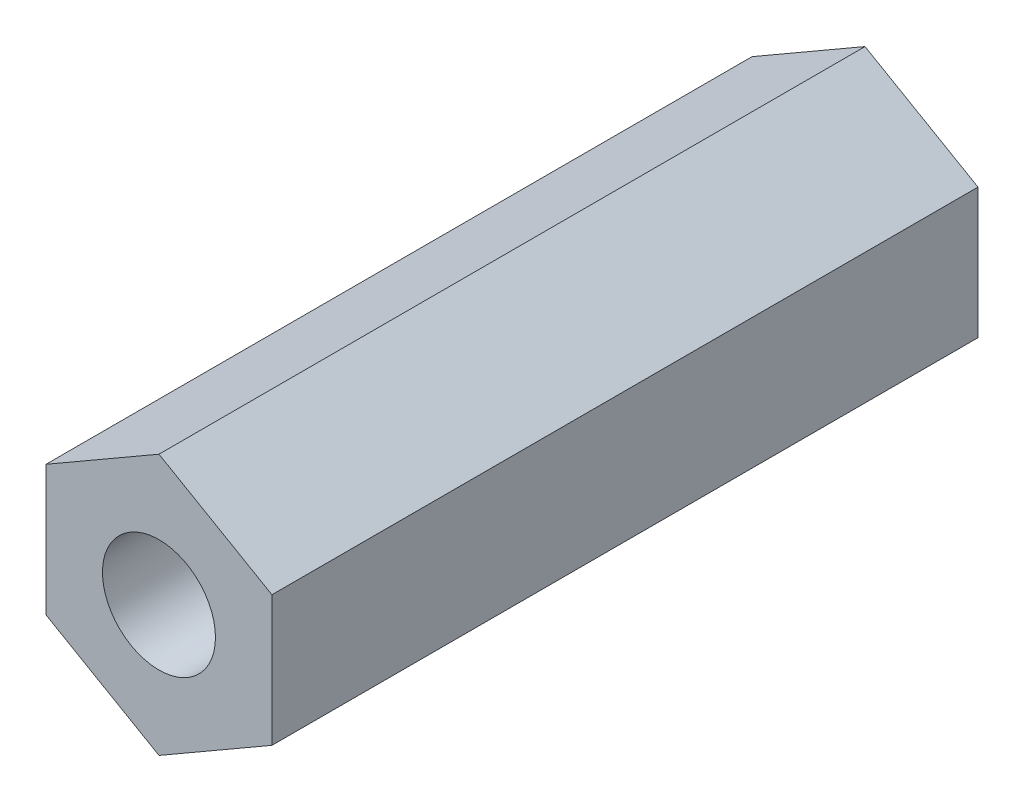
ISO-10303-21;
HEADER;
FILE_DESCRIPTION(('STEP AP214'),'2;1');
FILE_NAME('part.step','',(''),(''),'','','');
FILE_SCHEMA(('AUTOMOTIVE_DESIGN { 1 0 10303 214 1 1 1 1 }'));
ENDSEC;
DATA;
#1=APPLICATION_CONTEXT('core data for automotive mechanical design processes');
#2=APPLICATION_PROTOCOL_DEFINITION('international standard','automotive_design',2000,#1);
#3=PRODUCT_CONTEXT('',#1,'mechanical');
#4=PRODUCT('Part','Part','',(#3));
#5=PRODUCT_RELATED_PRODUCT_CATEGORY('part','',(#4));
#6=PRODUCT_DEFINITION_FORMATION('','',#4);
#7=PRODUCT_DEFINITION_CONTEXT('part definition',#1,'design');
#8=PRODUCT_DEFINITION('design','',#6,#7);
#9=PRODUCT_DEFINITION_SHAPE('','',#8);
#10=(LENGTH_UNIT() NAMED_UNIT(*) SI_UNIT(.MILLI.,.METRE.));
#11=(NAMED_UNIT(*) PLANE_ANGLE_UNIT() SI_UNIT($,.RADIAN.));
#12=(NAMED_UNIT(*) SI_UNIT($,.STERADIAN.) SOLID_ANGLE_UNIT());
#13=UNCERTAINTY_MEASURE_WITH_UNIT(LENGTH_MEASURE(1.E-05),#10,'distance_accuracy_value','');
#14=(GEOMETRIC_REPRESENTATION_CONTEXT(3) GLOBAL_UNCERTAINTY_ASSIGNED_CONTEXT((#13)) GLOBAL_UNIT_ASSIGNED_CONTEXT((#10,
#11,#12)) REPRESENTATION_CONTEXT('',''));
#15=CARTESIAN_POINT('',(0.,0.,0.));
#16=DIRECTION('',(0.,0.,1.));
#17=DIRECTION('',(1.,0.,0.));
#18=AXIS2_PLACEMENT_3D('',#15,#16,#17);
#19=CARTESIAN_POINT('',(0.,0.,25.));
#20=DIRECTION('',(0.,0.,1.));
#21=DIRECTION('',(1.,0.,0.));
#22=AXIS2_PLACEMENT_3D('',#19,#20,#21);
#23=PLANE('',#22);
#24=DIRECTION('',(0.866025403784438,0.5,0.));
#25=VECTOR('',#24,1.);
#26=CARTESIAN_POINT('',(0.,-4.61880215351701,25.));
#27=LINE('',#26,#25);
#28=CARTESIAN_POINT('',(0.,-4.61880215351701,25.));
#29=VERTEX_POINT('',#28);
#30=CARTESIAN_POINT('',(4.,-2.3094010767585,25.));
#31=VERTEX_POINT('',#30);
#32=EDGE_CURVE('E129',#29,#31,#27,.T.);
#33=ORIENTED_EDGE('',*,*,#32,.T.);
#34=DIRECTION('',(0.,1.,0.));
#35=VECTOR('',#34,1.);
#36=CARTESIAN_POINT('',(4.,-2.3094010767585,25.));
#37=LINE('',#36,#35);
#38=CARTESIAN_POINT('',(4.,2.3094010767585,25.));
#39=VERTEX_POINT('',#38);
#40=EDGE_CURVE('E87',#31,#39,#37,.T.);
#41=ORIENTED_EDGE('',*,*,#40,.T.);
#42=DIRECTION('',(-0.866025403784439,0.5,0.));
#43=VECTOR('',#42,1.);
#44=CARTESIAN_POINT('',(4.,2.3094010767585,25.));
#45=LINE('',#44,#43);
#46=CARTESIAN_POINT('',(0.,4.61880215351701,25.));
#47=VERTEX_POINT('',#46);
#48=EDGE_CURVE('E100',#39,#47,#45,.T.);
#49=ORIENTED_EDGE('',*,*,#48,.T.);
#50=DIRECTION('',(-0.866025403784439,-0.5,0.));
#51=VECTOR('',#50,1.);
#52=CARTESIAN_POINT('',(0.,4.61880215351701,25.));
#53=LINE('',#52,#51);
#54=CARTESIAN_POINT('',(-4.,2.3094010767585,25.));
#55=VERTEX_POINT('',#54);
#56=EDGE_CURVE('E94',#47,#55,#53,.T.);
#57=ORIENTED_EDGE('',*,*,#56,.T.);
#58=DIRECTION('',(0.,-1.,0.));
#59=VECTOR('',#58,1.);
#60=CARTESIAN_POINT('',(-4.,2.3094010767585,25.));
#61=LINE('',#60,#59);
#62=CARTESIAN_POINT('',(-4.,-2.3094010767585,25.));
#63=VERTEX_POINT('',#62);
#64=EDGE_CURVE('E98',#55,#63,#61,.T.);
#65=ORIENTED_EDGE('',*,*,#64,.T.);
#66=DIRECTION('',(0.866025403784438,-0.5,0.));
#67=VECTOR('',#66,1.);
#68=CARTESIAN_POINT('',(-4.,-2.3094010767585,25.));
#69=LINE('',#68,#67);
#70=EDGE_CURVE('E50',#63,#29,#69,.T.);
#71=ORIENTED_EDGE('',*,*,#70,.T.);
#72=EDGE_LOOP('',(#33,#41,#49,#57,#65,#71));
#73=FACE_BOUND('',#72,.T.);
#74=CARTESIAN_POINT('',(0.,0.,25.));
#75=DIRECTION('',(0.,0.,1.));
#76=DIRECTION('',(1.,0.,0.));
#77=AXIS2_PLACEMENT_3D('',#74,#75,#76);
#78=CIRCLE('',#77,2.);
#79=CARTESIAN_POINT('',(2.,0.,25.));
#80=VERTEX_POINT('',#79);
#81=EDGE_CURVE('E122',#80,#80,#78,.T.);
#82=ORIENTED_EDGE('',*,*,#81,.F.);
#83=EDGE_LOOP('',(#82));
#84=FACE_BOUND('',#83,.T.);
#85=ADVANCED_FACE('F33',(#73,#84),#23,.T.);
#86=CARTESIAN_POINT('',(0.,0.,0.));
#87=DIRECTION('',(0.,0.,1.));
#88=DIRECTION('',(1.,0.,0.));
#89=AXIS2_PLACEMENT_3D('',#86,#87,#88);
#90=PLANE('',#89);
#91=DIRECTION('',(0.866025403784438,0.5,0.));
#92=VECTOR('',#91,1.);
#93=CARTESIAN_POINT('',(0.,-4.61880215351701,0.));
#94=LINE('',#93,#92);
#95=CARTESIAN_POINT('',(0.,-4.61880215351701,0.));
#96=VERTEX_POINT('',#95);
#97=CARTESIAN_POINT('',(4.,-2.3094010767585,0.));
#98=VERTEX_POINT('',#97);
#99=EDGE_CURVE('E118',#96,#98,#94,.T.);
#100=ORIENTED_EDGE('',*,*,#99,.F.);
#101=DIRECTION('',(0.866025403784438,-0.5,0.));
#102=VECTOR('',#101,1.);
#103=CARTESIAN_POINT('',(-4.,-2.3094010767585,0.));
#104=LINE('',#103,#102);
#105=CARTESIAN_POINT('',(-4.,-2.3094010767585,0.));
#106=VERTEX_POINT('',#105);
#107=EDGE_CURVE('E79',#106,#96,#104,.T.);
#108=ORIENTED_EDGE('',*,*,#107,.F.);
#109=DIRECTION('',(0.,-1.,0.));
#110=VECTOR('',#109,1.);
#111=CARTESIAN_POINT('',(-4.,2.3094010767585,0.));
#112=LINE('',#111,#110);
#113=CARTESIAN_POINT('',(-4.,2.3094010767585,0.));
#114=VERTEX_POINT('',#113);
#115=EDGE_CURVE('E73',#114,#106,#112,.T.);
#116=ORIENTED_EDGE('',*,*,#115,.F.);
#117=DIRECTION('',(-0.866025403784439,-0.5,0.));
#118=VECTOR('',#117,1.);
#119=CARTESIAN_POINT('',(0.,4.61880215351701,0.));
#120=LINE('',#119,#118);
#121=CARTESIAN_POINT('',(0.,4.61880215351701,0.));
#122=VERTEX_POINT('',#121);
#123=EDGE_CURVE('E108',#122,#114,#120,.T.);
#124=ORIENTED_EDGE('',*,*,#123,.F.);
#125=DIRECTION('',(-0.866025403784439,0.5,0.));
#126=VECTOR('',#125,1.);
#127=CARTESIAN_POINT('',(4.,2.3094010767585,0.));
#128=LINE('',#127,#126);
#129=CARTESIAN_POINT('',(4.,2.3094010767585,0.));
#130=VERTEX_POINT('',#129);
#131=EDGE_CURVE('E124',#130,#122,#128,.T.);
#132=ORIENTED_EDGE('',*,*,#131,.F.);
#133=DIRECTION('',(0.,1.,0.));
#134=VECTOR('',#133,1.);
#135=CARTESIAN_POINT('',(4.,-2.3094010767585,0.));
#136=LINE('',#135,#134);
#137=EDGE_CURVE('E121',#98,#130,#136,.T.);
#138=ORIENTED_EDGE('',*,*,#137,.F.);
#139=EDGE_LOOP('',(#100,#108,#116,#124,#132,#138));
#140=FACE_BOUND('',#139,.T.);
#141=CARTESIAN_POINT('',(0.,0.,0.));
#142=DIRECTION('',(0.,0.,1.));
#143=DIRECTION('',(1.,0.,0.));
#144=AXIS2_PLACEMENT_3D('',#141,#142,#143);
#145=CIRCLE('',#144,2.);
#146=CARTESIAN_POINT('',(2.,0.,0.));
#147=VERTEX_POINT('',#146);
#148=EDGE_CURVE('E222',#147,#147,#145,.T.);
#149=ORIENTED_EDGE('',*,*,#148,.T.);
#150=EDGE_LOOP('',(#149));
#151=FACE_BOUND('',#150,.T.);
#152=ADVANCED_FACE('F138',(#140,#151),#90,.F.);
#153=CARTESIAN_POINT('',(0.,-4.61880215351701,25.));
#154=DIRECTION('',(-0.5,0.866025403784438,0.));
#155=DIRECTION('',(-0.866025403784439,-0.5,0.));
#156=AXIS2_PLACEMENT_3D('',#153,#154,#155);
#157=PLANE('',#156);
#158=ORIENTED_EDGE('',*,*,#99,.T.);
#159=DIRECTION('',(0.,0.,-1.));
#160=VECTOR('',#159,1.);
#161=CARTESIAN_POINT('',(4.,-2.3094010767585,25.));
#162=LINE('',#161,#160);
#163=EDGE_CURVE('E11',#31,#98,#162,.T.);
#164=ORIENTED_EDGE('',*,*,#163,.F.);
#165=ORIENTED_EDGE('',*,*,#32,.F.);
#166=DIRECTION('',(0.,0.,-1.));
#167=VECTOR('',#166,1.);
#168=CARTESIAN_POINT('',(0.,-4.61880215351701,25.));
#169=LINE('',#168,#167);
#170=EDGE_CURVE('E114',#29,#96,#169,.T.);
#171=ORIENTED_EDGE('',*,*,#170,.T.);
#172=EDGE_LOOP('',(#158,#164,#165,#171));
#173=FACE_BOUND('',#172,.T.);
#174=ADVANCED_FACE('F35',(#173),#157,.F.);
#175=CARTESIAN_POINT('',(4.,-2.3094010767585,25.));
#176=DIRECTION('',(-1.,0.,0.));
#177=DIRECTION('',(0.,0.,1.));
#178=AXIS2_PLACEMENT_3D('',#175,#176,#177);
#179=PLANE('',#178);
#180=ORIENTED_EDGE('',*,*,#137,.T.);
#181=DIRECTION('',(0.,0.,-1.));
#182=VECTOR('',#181,1.);
#183=CARTESIAN_POINT('',(4.,2.3094010767585,25.));
#184=LINE('',#183,#182);
#185=EDGE_CURVE('E42',#39,#130,#184,.T.);
#186=ORIENTED_EDGE('',*,*,#185,.F.);
#187=ORIENTED_EDGE('',*,*,#40,.F.);
#188=ORIENTED_EDGE('',*,*,#163,.T.);
#189=EDGE_LOOP('',(#180,#186,#187,#188));
#190=FACE_BOUND('',#189,.T.);
#191=ADVANCED_FACE('F163',(#190),#179,.F.);
#192=CARTESIAN_POINT('',(4.,2.3094010767585,25.));
#193=DIRECTION('',(-0.5,-0.866025403784439,0.));
#194=DIRECTION('',(0.866025403784439,-0.5,0.));
#195=AXIS2_PLACEMENT_3D('',#192,#193,#194);
#196=PLANE('',#195);
#197=ORIENTED_EDGE('',*,*,#131,.T.);
#198=DIRECTION('',(0.,0.,-1.));
#199=VECTOR('',#198,1.);
#200=CARTESIAN_POINT('',(0.,4.61880215351701,25.));
#201=LINE('',#200,#199);
#202=EDGE_CURVE('E109',#47,#122,#201,.T.);
#203=ORIENTED_EDGE('',*,*,#202,.F.);
#204=ORIENTED_EDGE('',*,*,#48,.F.);
#205=ORIENTED_EDGE('',*,*,#185,.T.);
#206=EDGE_LOOP('',(#197,#203,#204,#205));
#207=FACE_BOUND('',#206,.T.);
#208=ADVANCED_FACE('F135',(#207),#196,.F.);
#209=CARTESIAN_POINT('',(0.,4.61880215351701,25.));
#210=DIRECTION('',(0.5,-0.866025403784439,0.));
#211=DIRECTION('',(0.866025403784439,0.5,0.));
#212=AXIS2_PLACEMENT_3D('',#209,#210,#211);
#213=PLANE('',#212);
#214=ORIENTED_EDGE('',*,*,#123,.T.);
#215=DIRECTION('',(0.,0.,-1.));
#216=VECTOR('',#215,1.);
#217=CARTESIAN_POINT('',(-4.,2.3094010767585,25.));
#218=LINE('',#217,#216);
#219=EDGE_CURVE('E105',#55,#114,#218,.T.);
#220=ORIENTED_EDGE('',*,*,#219,.F.);
#221=ORIENTED_EDGE('',*,*,#56,.F.);
#222=ORIENTED_EDGE('',*,*,#202,.T.);
#223=EDGE_LOOP('',(#214,#220,#221,#222));
#224=FACE_BOUND('',#223,.T.);
#225=ADVANCED_FACE('F106',(#224),#213,.F.);
#226=CARTESIAN_POINT('',(-4.,2.3094010767585,25.));
#227=DIRECTION('',(1.,0.,0.));
#228=DIRECTION('',(0.,1.,0.));
#229=AXIS2_PLACEMENT_3D('',#226,#227,#228);
#230=PLANE('',#229);
#231=ORIENTED_EDGE('',*,*,#115,.T.);
#232=DIRECTION('',(0.,0.,-1.));
#233=VECTOR('',#232,1.);
#234=CARTESIAN_POINT('',(-4.,-2.3094010767585,25.));
#235=LINE('',#234,#233);
#236=EDGE_CURVE('E110',#63,#106,#235,.T.);
#237=ORIENTED_EDGE('',*,*,#236,.F.);
#238=ORIENTED_EDGE('',*,*,#64,.F.);
#239=ORIENTED_EDGE('',*,*,#219,.T.);
#240=EDGE_LOOP('',(#231,#237,#238,#239));
#241=FACE_BOUND('',#240,.T.);
#242=ADVANCED_FACE('F112',(#241),#230,.F.);
#243=CARTESIAN_POINT('',(-4.,-2.3094010767585,25.));
#244=DIRECTION('',(0.5,0.866025403784438,0.));
#245=DIRECTION('',(-0.866025403784439,0.5,0.));
#246=AXIS2_PLACEMENT_3D('',#243,#244,#245);
#247=PLANE('',#246);
#248=ORIENTED_EDGE('',*,*,#107,.T.);
#249=ORIENTED_EDGE('',*,*,#170,.F.);
#250=ORIENTED_EDGE('',*,*,#70,.F.);
#251=ORIENTED_EDGE('',*,*,#236,.T.);
#252=EDGE_LOOP('',(#248,#249,#250,#251));
#253=FACE_BOUND('',#252,.T.);
#254=ADVANCED_FACE('F143',(#253),#247,.F.);
#255=CARTESIAN_POINT('',(0.,0.,25.));
#256=DIRECTION('',(0.,0.,-1.));
#257=DIRECTION('',(-1.,0.,0.));
#258=AXIS2_PLACEMENT_3D('',#255,#256,#257);
#259=CYLINDRICAL_SURFACE('',#258,2.);
#260=ORIENTED_EDGE('',*,*,#81,.T.);
#261=EDGE_LOOP('',(#260));
#262=FACE_BOUND('',#261,.T.);
#263=ORIENTED_EDGE('',*,*,#148,.F.);
#264=EDGE_LOOP('',(#263));
#265=FACE_BOUND('',#264,.T.);
#266=ADVANCED_FACE('F145',(#262,#265),#259,.F.);
#267=CLOSED_SHELL('',(#85,#152,#174,#191,#208,#225,#242,#254,#266));
#268=MANIFOLD_SOLID_BREP('B2',#267);
#269=ADVANCED_BREP_SHAPE_REPRESENTATION('',(#18,#268),#14);
#270=SHAPE_DEFINITION_REPRESENTATION(#9,#269);
ENDSEC;
END-ISO-10303-21;
